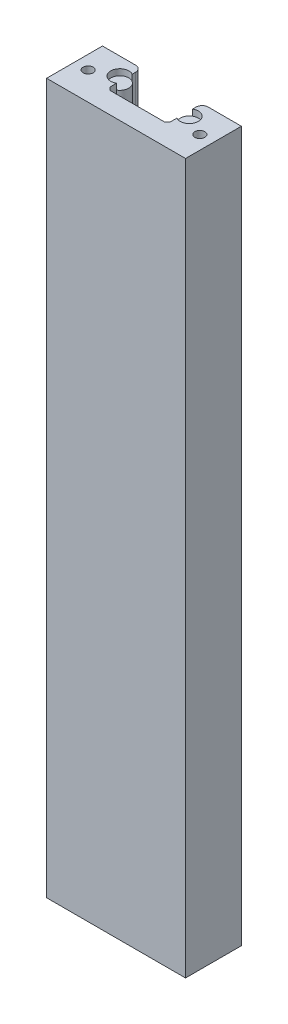
ISO-10303-21;
HEADER;
FILE_DESCRIPTION(('STEP AP214'),'2;1');
FILE_NAME('part.step','',(''),(''),'','','');
FILE_SCHEMA(('AUTOMOTIVE_DESIGN { 1 0 10303 214 1 1 1 1 }'));
ENDSEC;
DATA;
#1=APPLICATION_CONTEXT('core data for automotive mechanical design processes');
#2=APPLICATION_PROTOCOL_DEFINITION('international standard','automotive_design',2000,#1);
#3=PRODUCT_CONTEXT('',#1,'mechanical');
#4=PRODUCT('Part','Part','',(#3));
#5=PRODUCT_RELATED_PRODUCT_CATEGORY('part','',(#4));
#6=PRODUCT_DEFINITION_FORMATION('','',#4);
#7=PRODUCT_DEFINITION_CONTEXT('part definition',#1,'design');
#8=PRODUCT_DEFINITION('design','',#6,#7);
#9=PRODUCT_DEFINITION_SHAPE('','',#8);
#10=(LENGTH_UNIT() NAMED_UNIT(*) SI_UNIT(.MILLI.,.METRE.));
#11=(NAMED_UNIT(*) PLANE_ANGLE_UNIT() SI_UNIT($,.RADIAN.));
#12=(NAMED_UNIT(*) SI_UNIT($,.STERADIAN.) SOLID_ANGLE_UNIT());
#13=UNCERTAINTY_MEASURE_WITH_UNIT(LENGTH_MEASURE(1.E-05),#10,'distance_accuracy_value','');
#14=(GEOMETRIC_REPRESENTATION_CONTEXT(3) GLOBAL_UNCERTAINTY_ASSIGNED_CONTEXT((#13)) GLOBAL_UNIT_ASSIGNED_CONTEXT((#10,
#11,#12)) REPRESENTATION_CONTEXT('',''));
#15=CARTESIAN_POINT('',(0.,0.,0.));
#16=DIRECTION('',(0.,0.,1.));
#17=DIRECTION('',(1.,0.,0.));
#18=AXIS2_PLACEMENT_3D('',#15,#16,#17);
#19=CARTESIAN_POINT('',(11.5,115.5,-12.75));
#20=DIRECTION('',(0.,-1.,0.));
#21=DIRECTION('',(0.,0.,-1.));
#22=AXIS2_PLACEMENT_3D('',#19,#20,#21);
#23=CYLINDRICAL_SURFACE('',#22,2.95);
#24=CARTESIAN_POINT('',(11.5,115.5,-12.75));
#25=DIRECTION('',(0.,1.,0.));
#26=DIRECTION('',(0.,0.,-1.));
#27=AXIS2_PLACEMENT_3D('',#24,#25,#26);
#28=CIRCLE('',#27,2.95);
#29=CARTESIAN_POINT('',(11.5,115.5,-15.7));
#30=VERTEX_POINT('',#29);
#31=EDGE_CURVE('E11',#30,#30,#28,.T.);
#32=ORIENTED_EDGE('',*,*,#31,.F.);
#33=EDGE_LOOP('',(#32));
#34=FACE_BOUND('',#33,.T.);
#35=CARTESIAN_POINT('',(11.5,-115.5,-12.75));
#36=DIRECTION('',(0.,1.,0.));
#37=DIRECTION('',(0.,0.,-1.));
#38=AXIS2_PLACEMENT_3D('',#35,#36,#37);
#39=CIRCLE('',#38,2.95);
#40=CARTESIAN_POINT('',(11.5,-115.5,-15.7));
#41=VERTEX_POINT('',#40);
#42=EDGE_CURVE('E45',#41,#41,#39,.T.);
#43=ORIENTED_EDGE('',*,*,#42,.T.);
#44=EDGE_LOOP('',(#43));
#45=FACE_BOUND('',#44,.T.);
#46=ADVANCED_FACE('F42',(#34,#45),#23,.T.);
#47=CARTESIAN_POINT('',(11.5,115.5,-12.75));
#48=DIRECTION('',(0.,-1.,0.));
#49=DIRECTION('',(0.,0.,-1.));
#50=AXIS2_PLACEMENT_3D('',#47,#48,#49);
#51=PLANE('',#50);
#52=ORIENTED_EDGE('',*,*,#31,.T.);
#53=EDGE_LOOP('',(#52));
#54=FACE_BOUND('',#53,.T.);
#55=ADVANCED_FACE('F57',(#54),#51,.F.);
#56=CARTESIAN_POINT('',(11.5,-115.5,-12.75));
#57=DIRECTION('',(0.,-1.,0.));
#58=DIRECTION('',(0.,0.,-1.));
#59=AXIS2_PLACEMENT_3D('',#56,#57,#58);
#60=PLANE('',#59);
#61=ORIENTED_EDGE('',*,*,#42,.F.);
#62=EDGE_LOOP('',(#61));
#63=FACE_BOUND('',#62,.T.);
#64=ADVANCED_FACE('F55',(#63),#60,.T.);
#65=CLOSED_SHELL('',(#46,#55,#64));
#66=MANIFOLD_SOLID_BREP('B2',#65);
#67=CARTESIAN_POINT('',(-11.5,115.5,-12.75));
#68=DIRECTION('',(0.,-1.,0.));
#69=DIRECTION('',(0.,0.,-1.));
#70=AXIS2_PLACEMENT_3D('',#67,#68,#69);
#71=CYLINDRICAL_SURFACE('',#70,2.95);
#72=CARTESIAN_POINT('',(-11.5,115.5,-12.75));
#73=DIRECTION('',(0.,1.,0.));
#74=DIRECTION('',(0.,0.,1.));
#75=AXIS2_PLACEMENT_3D('',#72,#73,#74);
#76=CIRCLE('',#75,2.95);
#77=CARTESIAN_POINT('',(-11.5,115.5,-9.79999999999999));
#78=VERTEX_POINT('',#77);
#79=EDGE_CURVE('E41',#78,#78,#76,.T.);
#80=ORIENTED_EDGE('',*,*,#79,.F.);
#81=EDGE_LOOP('',(#80));
#82=FACE_BOUND('',#81,.T.);
#83=CARTESIAN_POINT('',(-11.5,-115.5,-12.75));
#84=DIRECTION('',(0.,1.,0.));
#85=DIRECTION('',(0.,0.,1.));
#86=AXIS2_PLACEMENT_3D('',#83,#84,#85);
#87=CIRCLE('',#86,2.95);
#88=CARTESIAN_POINT('',(-11.5,-115.5,-9.79999999999999));
#89=VERTEX_POINT('',#88);
#90=EDGE_CURVE('E95',#89,#89,#87,.T.);
#91=ORIENTED_EDGE('',*,*,#90,.T.);
#92=EDGE_LOOP('',(#91));
#93=FACE_BOUND('',#92,.T.);
#94=ADVANCED_FACE('F92',(#82,#93),#71,.T.);
#95=CARTESIAN_POINT('',(-11.5,115.5,-12.75));
#96=DIRECTION('',(0.,1.,0.));
#97=DIRECTION('',(0.,0.,1.));
#98=AXIS2_PLACEMENT_3D('',#95,#96,#97);
#99=PLANE('',#98);
#100=ORIENTED_EDGE('',*,*,#79,.T.);
#101=EDGE_LOOP('',(#100));
#102=FACE_BOUND('',#101,.T.);
#103=ADVANCED_FACE('F107',(#102),#99,.T.);
#104=CARTESIAN_POINT('',(-11.5,-115.5,-12.75));
#105=DIRECTION('',(0.,1.,0.));
#106=DIRECTION('',(0.,0.,1.));
#107=AXIS2_PLACEMENT_3D('',#104,#105,#106);
#108=PLANE('',#107);
#109=ORIENTED_EDGE('',*,*,#90,.F.);
#110=EDGE_LOOP('',(#109));
#111=FACE_BOUND('',#110,.T.);
#112=ADVANCED_FACE('F105',(#111),#108,.F.);
#113=CLOSED_SHELL('',(#94,#103,#112));
#114=MANIFOLD_SOLID_BREP('B6',#113);
#115=CARTESIAN_POINT('',(-23.,117.5,0.));
#116=DIRECTION('',(1.,0.,0.));
#117=DIRECTION('',(0.,0.,-1.));
#118=AXIS2_PLACEMENT_3D('',#115,#116,#117);
#119=PLANE('',#118);
#120=DIRECTION('',(0.,0.,1.));
#121=VECTOR('',#120,1.);
#122=CARTESIAN_POINT('',(-23.,-117.5,0.));
#123=LINE('',#122,#121);
#124=CARTESIAN_POINT('',(-23.,-117.5,-18.5));
#125=VERTEX_POINT('',#124);
#126=CARTESIAN_POINT('',(-23.,-117.5,0.));
#127=VERTEX_POINT('',#126);
#128=EDGE_CURVE('E268',#125,#127,#123,.T.);
#129=ORIENTED_EDGE('',*,*,#128,.T.);
#130=DIRECTION('',(0.,-1.,0.));
#131=VECTOR('',#130,1.);
#132=CARTESIAN_POINT('',(-23.,117.5,0.));
#133=LINE('',#132,#131);
#134=CARTESIAN_POINT('',(-23.,117.5,0.));
#135=VERTEX_POINT('',#134);
#136=EDGE_CURVE('E250',#135,#127,#133,.T.);
#137=ORIENTED_EDGE('',*,*,#136,.F.);
#138=DIRECTION('',(0.,0.,1.));
#139=VECTOR('',#138,1.);
#140=CARTESIAN_POINT('',(-23.,117.5,0.));
#141=LINE('',#140,#139);
#142=CARTESIAN_POINT('',(-23.,117.5,-18.5));
#143=VERTEX_POINT('',#142);
#144=EDGE_CURVE('E256',#143,#135,#141,.T.);
#145=ORIENTED_EDGE('',*,*,#144,.F.);
#146=DIRECTION('',(0.,-1.,0.));
#147=VECTOR('',#146,1.);
#148=CARTESIAN_POINT('',(-23.,117.5,-18.5));
#149=LINE('',#148,#147);
#150=EDGE_CURVE('E319',#143,#125,#149,.T.);
#151=ORIENTED_EDGE('',*,*,#150,.T.);
#152=EDGE_LOOP('',(#129,#137,#145,#151));
#153=FACE_BOUND('',#152,.T.);
#154=ADVANCED_FACE('F133',(#153),#119,.F.);
#155=CARTESIAN_POINT('',(23.,117.5,0.));
#156=DIRECTION('',(0.,0.,-1.));
#157=DIRECTION('',(-1.,0.,0.));
#158=AXIS2_PLACEMENT_3D('',#155,#156,#157);
#159=PLANE('',#158);
#160=DIRECTION('',(1.,0.,0.));
#161=VECTOR('',#160,1.);
#162=CARTESIAN_POINT('',(23.,-117.5,0.));
#163=LINE('',#162,#161);
#164=CARTESIAN_POINT('',(23.,-117.5,0.));
#165=VERTEX_POINT('',#164);
#166=EDGE_CURVE('E349',#127,#165,#163,.T.);
#167=ORIENTED_EDGE('',*,*,#166,.T.);
#168=DIRECTION('',(0.,-1.,0.));
#169=VECTOR('',#168,1.);
#170=CARTESIAN_POINT('',(23.,117.5,0.));
#171=LINE('',#170,#169);
#172=CARTESIAN_POINT('',(23.,117.5,0.));
#173=VERTEX_POINT('',#172);
#174=EDGE_CURVE('E253',#173,#165,#171,.T.);
#175=ORIENTED_EDGE('',*,*,#174,.F.);
#176=DIRECTION('',(1.,0.,0.));
#177=VECTOR('',#176,1.);
#178=CARTESIAN_POINT('',(23.,117.5,0.));
#179=LINE('',#178,#177);
#180=EDGE_CURVE('E246',#135,#173,#179,.T.);
#181=ORIENTED_EDGE('',*,*,#180,.F.);
#182=ORIENTED_EDGE('',*,*,#136,.T.);
#183=EDGE_LOOP('',(#167,#175,#181,#182));
#184=FACE_BOUND('',#183,.T.);
#185=ADVANCED_FACE('F248',(#184),#159,.F.);
#186=CARTESIAN_POINT('',(23.,117.5,0.));
#187=DIRECTION('',(-1.,0.,0.));
#188=DIRECTION('',(0.,0.,1.));
#189=AXIS2_PLACEMENT_3D('',#186,#187,#188);
#190=PLANE('',#189);
#191=DIRECTION('',(0.,0.,-1.));
#192=VECTOR('',#191,1.);
#193=CARTESIAN_POINT('',(23.,-117.5,0.));
#194=LINE('',#193,#192);
#195=CARTESIAN_POINT('',(23.,-117.5,-18.5));
#196=VERTEX_POINT('',#195);
#197=EDGE_CURVE('E344',#165,#196,#194,.T.);
#198=ORIENTED_EDGE('',*,*,#197,.T.);
#199=DIRECTION('',(0.,-1.,0.));
#200=VECTOR('',#199,1.);
#201=CARTESIAN_POINT('',(23.,117.5,-18.5));
#202=LINE('',#201,#200);
#203=CARTESIAN_POINT('',(23.,117.5,-18.5));
#204=VERTEX_POINT('',#203);
#205=EDGE_CURVE('E273',#204,#196,#202,.T.);
#206=ORIENTED_EDGE('',*,*,#205,.F.);
#207=DIRECTION('',(0.,0.,-1.));
#208=VECTOR('',#207,1.);
#209=CARTESIAN_POINT('',(23.,117.5,0.));
#210=LINE('',#209,#208);
#211=EDGE_CURVE('E255',#173,#204,#210,.T.);
#212=ORIENTED_EDGE('',*,*,#211,.F.);
#213=ORIENTED_EDGE('',*,*,#174,.T.);
#214=EDGE_LOOP('',(#198,#206,#212,#213));
#215=FACE_BOUND('',#214,.T.);
#216=ADVANCED_FACE('F378',(#215),#190,.F.);
#217=CARTESIAN_POINT('',(23.,117.5,-18.5));
#218=DIRECTION('',(0.,0.,1.));
#219=DIRECTION('',(1.,0.,0.));
#220=AXIS2_PLACEMENT_3D('',#217,#218,#219);
#221=PLANE('',#220);
#222=DIRECTION('',(-1.,0.,0.));
#223=VECTOR('',#222,1.);
#224=CARTESIAN_POINT('',(23.,-117.5,-18.5));
#225=LINE('',#224,#223);
#226=CARTESIAN_POINT('',(12.,-117.5,-18.5));
#227=VERTEX_POINT('',#226);
#228=EDGE_CURVE('E339',#196,#227,#225,.T.);
#229=ORIENTED_EDGE('',*,*,#228,.T.);
#230=DIRECTION('',(0.,-1.,0.));
#231=VECTOR('',#230,1.);
#232=CARTESIAN_POINT('',(12.,117.5,-18.5));
#233=LINE('',#232,#231);
#234=CARTESIAN_POINT('',(12.,117.5,-18.5));
#235=VERTEX_POINT('',#234);
#236=EDGE_CURVE('E299',#227,#235,#233,.F.);
#237=ORIENTED_EDGE('',*,*,#236,.T.);
#238=DIRECTION('',(-1.,0.,0.));
#239=VECTOR('',#238,1.);
#240=CARTESIAN_POINT('',(23.,117.5,-18.5));
#241=LINE('',#240,#239);
#242=EDGE_CURVE('E341',#204,#235,#241,.T.);
#243=ORIENTED_EDGE('',*,*,#242,.F.);
#244=ORIENTED_EDGE('',*,*,#205,.T.);
#245=EDGE_LOOP('',(#229,#237,#243,#244));
#246=FACE_BOUND('',#245,.T.);
#247=ADVANCED_FACE('F338',(#246),#221,.F.);
#248=CARTESIAN_POINT('',(10.,117.5,-18.5));
#249=DIRECTION('',(1.,0.,0.));
#250=DIRECTION('',(0.,0.,-1.));
#251=AXIS2_PLACEMENT_3D('',#248,#249,#250);
#252=PLANE('',#251);
#253=DIRECTION('',(0.,0.,1.));
#254=VECTOR('',#253,1.);
#255=CARTESIAN_POINT('',(10.,117.5,-18.5));
#256=LINE('',#255,#254);
#257=CARTESIAN_POINT('',(10.,117.5,-16.5));
#258=VERTEX_POINT('',#257);
#259=CARTESIAN_POINT('',(10.,117.5,-15.3480762113533));
#260=VERTEX_POINT('',#259);
#261=EDGE_CURVE('E380',#258,#260,#256,.T.);
#262=ORIENTED_EDGE('',*,*,#261,.F.);
#263=DIRECTION('',(0.,-1.,0.));
#264=VECTOR('',#263,1.);
#265=CARTESIAN_POINT('',(10.,117.5,-16.5));
#266=LINE('',#265,#264);
#267=CARTESIAN_POINT('',(10.,-117.5,-16.5));
#268=VERTEX_POINT('',#267);
#269=EDGE_CURVE('E292',#258,#268,#266,.T.);
#270=ORIENTED_EDGE('',*,*,#269,.T.);
#271=DIRECTION('',(0.,0.,1.));
#272=VECTOR('',#271,1.);
#273=CARTESIAN_POINT('',(10.,-117.5,-18.5));
#274=LINE('',#273,#272);
#275=CARTESIAN_POINT('',(10.,-117.5,-15.3480762113533));
#276=VERTEX_POINT('',#275);
#277=EDGE_CURVE('E345',#268,#276,#274,.T.);
#278=ORIENTED_EDGE('',*,*,#277,.T.);
#279=DIRECTION('',(0.,-1.,0.));
#280=VECTOR('',#279,1.);
#281=CARTESIAN_POINT('',(10.,117.5,-15.3480762113533));
#282=LINE('',#281,#280);
#283=EDGE_CURVE('E330',#260,#276,#282,.T.);
#284=ORIENTED_EDGE('',*,*,#283,.F.);
#285=EDGE_LOOP('',(#262,#270,#278,#284));
#286=FACE_BOUND('',#285,.T.);
#287=ADVANCED_FACE('F432',(#286),#252,.F.);
#288=CARTESIAN_POINT('',(11.5,117.5,-12.75));
#289=DIRECTION('',(0.,-1.,0.));
#290=DIRECTION('',(0.,0.,-1.));
#291=AXIS2_PLACEMENT_3D('',#288,#289,#290);
#292=CYLINDRICAL_SURFACE('',#291,3.);
#293=CARTESIAN_POINT('',(11.5,-117.5,-12.75));
#294=DIRECTION('',(0.,-1.,0.));
#295=DIRECTION('',(0.,0.,-1.));
#296=AXIS2_PLACEMENT_3D('',#293,#294,#295);
#297=CIRCLE('',#296,3.);
#298=CARTESIAN_POINT('',(10.,-117.5,-10.1519237886467));
#299=VERTEX_POINT('',#298);
#300=EDGE_CURVE('E347',#276,#299,#297,.T.);
#301=ORIENTED_EDGE('',*,*,#300,.T.);
#302=DIRECTION('',(0.,-1.,0.));
#303=VECTOR('',#302,1.);
#304=CARTESIAN_POINT('',(10.,117.5,-10.1519237886467));
#305=LINE('',#304,#303);
#306=CARTESIAN_POINT('',(10.,117.5,-10.1519237886467));
#307=VERTEX_POINT('',#306);
#308=EDGE_CURVE('E327',#307,#299,#305,.T.);
#309=ORIENTED_EDGE('',*,*,#308,.F.);
#310=CARTESIAN_POINT('',(11.5,117.5,-12.75));
#311=DIRECTION('',(0.,-1.,0.));
#312=DIRECTION('',(0.,0.,-1.));
#313=AXIS2_PLACEMENT_3D('',#310,#311,#312);
#314=CIRCLE('',#313,3.);
#315=EDGE_CURVE('E384',#260,#307,#314,.T.);
#316=ORIENTED_EDGE('',*,*,#315,.F.);
#317=ORIENTED_EDGE('',*,*,#283,.T.);
#318=EDGE_LOOP('',(#301,#309,#316,#317));
#319=FACE_BOUND('',#318,.T.);
#320=ADVANCED_FACE('F435',(#319),#292,.F.);
#321=CARTESIAN_POINT('',(10.,117.5,-10.1519237886467));
#322=DIRECTION('',(1.,0.,0.));
#323=DIRECTION('',(0.,0.,-1.));
#324=AXIS2_PLACEMENT_3D('',#321,#322,#323);
#325=PLANE('',#324);
#326=DIRECTION('',(0.,0.,1.));
#327=VECTOR('',#326,1.);
#328=CARTESIAN_POINT('',(10.,-117.5,-10.1519237886467));
#329=LINE('',#328,#327);
#330=CARTESIAN_POINT('',(10.,-117.5,-8.));
#331=VERTEX_POINT('',#330);
#332=EDGE_CURVE('E354',#299,#331,#329,.T.);
#333=ORIENTED_EDGE('',*,*,#332,.T.);
#334=DIRECTION('',(0.,1.,0.));
#335=VECTOR('',#334,1.);
#336=CARTESIAN_POINT('',(10.,117.5,-8.));
#337=LINE('',#336,#335);
#338=CARTESIAN_POINT('',(10.,117.5,-8.));
#339=VERTEX_POINT('',#338);
#340=EDGE_CURVE('E279',#331,#339,#337,.T.);
#341=ORIENTED_EDGE('',*,*,#340,.T.);
#342=DIRECTION('',(0.,0.,1.));
#343=VECTOR('',#342,1.);
#344=CARTESIAN_POINT('',(10.,117.5,-10.1519237886467));
#345=LINE('',#344,#343);
#346=EDGE_CURVE('E386',#307,#339,#345,.T.);
#347=ORIENTED_EDGE('',*,*,#346,.F.);
#348=ORIENTED_EDGE('',*,*,#308,.T.);
#349=EDGE_LOOP('',(#333,#341,#347,#348));
#350=FACE_BOUND('',#349,.T.);
#351=ADVANCED_FACE('F439',(#350),#325,.F.);
#352=CARTESIAN_POINT('',(-10.,117.5,-7.));
#353=DIRECTION('',(0.,0.,1.));
#354=DIRECTION('',(1.,0.,0.));
#355=AXIS2_PLACEMENT_3D('',#352,#353,#354);
#356=PLANE('',#355);
#357=DIRECTION('',(-1.,0.,0.));
#358=VECTOR('',#357,1.);
#359=CARTESIAN_POINT('',(-10.,117.5,-7.));
#360=LINE('',#359,#358);
#361=CARTESIAN_POINT('',(9.,117.5,-7.));
#362=VERTEX_POINT('',#361);
#363=CARTESIAN_POINT('',(-8.99999999999997,117.5,-7.));
#364=VERTEX_POINT('',#363);
#365=EDGE_CURVE('E389',#362,#364,#360,.T.);
#366=ORIENTED_EDGE('',*,*,#365,.F.);
#367=DIRECTION('',(0.,-1.,0.));
#368=VECTOR('',#367,1.);
#369=CARTESIAN_POINT('',(9.,-117.5,-7.));
#370=LINE('',#369,#368);
#371=CARTESIAN_POINT('',(9.,-117.5,-7.));
#372=VERTEX_POINT('',#371);
#373=EDGE_CURVE('E271',#362,#372,#370,.T.);
#374=ORIENTED_EDGE('',*,*,#373,.T.);
#375=DIRECTION('',(-1.,0.,0.));
#376=VECTOR('',#375,1.);
#377=CARTESIAN_POINT('',(-10.,-117.5,-7.));
#378=LINE('',#377,#376);
#379=CARTESIAN_POINT('',(-8.99999999999997,-117.5,-7.));
#380=VERTEX_POINT('',#379);
#381=EDGE_CURVE('E357',#372,#380,#378,.T.);
#382=ORIENTED_EDGE('',*,*,#381,.T.);
#383=DIRECTION('',(0.,1.,0.));
#384=VECTOR('',#383,1.);
#385=CARTESIAN_POINT('',(-8.99999999999997,117.5,-7.));
#386=LINE('',#385,#384);
#387=EDGE_CURVE('E269',#380,#364,#386,.T.);
#388=ORIENTED_EDGE('',*,*,#387,.T.);
#389=EDGE_LOOP('',(#366,#374,#382,#388));
#390=FACE_BOUND('',#389,.T.);
#391=ADVANCED_FACE('F401',(#390),#356,.F.);
#392=CARTESIAN_POINT('',(-10.,117.5,-10.1519237886467));
#393=DIRECTION('',(-1.,0.,0.));
#394=DIRECTION('',(0.,0.,1.));
#395=AXIS2_PLACEMENT_3D('',#392,#393,#394);
#396=PLANE('',#395);
#397=DIRECTION('',(0.,0.,-1.));
#398=VECTOR('',#397,1.);
#399=CARTESIAN_POINT('',(-10.,117.5,-10.1519237886467));
#400=LINE('',#399,#398);
#401=CARTESIAN_POINT('',(-10.,117.5,-8.));
#402=VERTEX_POINT('',#401);
#403=CARTESIAN_POINT('',(-10.,117.5,-10.1519237886467));
#404=VERTEX_POINT('',#403);
#405=EDGE_CURVE('E373',#402,#404,#400,.T.);
#406=ORIENTED_EDGE('',*,*,#405,.F.);
#407=DIRECTION('',(0.,-1.,0.));
#408=VECTOR('',#407,1.);
#409=CARTESIAN_POINT('',(-10.,-117.5,-8.));
#410=LINE('',#409,#408);
#411=CARTESIAN_POINT('',(-10.,-117.5,-8.));
#412=VERTEX_POINT('',#411);
#413=EDGE_CURVE('E281',#402,#412,#410,.T.);
#414=ORIENTED_EDGE('',*,*,#413,.T.);
#415=DIRECTION('',(0.,0.,-1.));
#416=VECTOR('',#415,1.);
#417=CARTESIAN_POINT('',(-10.,-117.5,-10.1519237886467));
#418=LINE('',#417,#416);
#419=CARTESIAN_POINT('',(-10.,-117.5,-10.1519237886467));
#420=VERTEX_POINT('',#419);
#421=EDGE_CURVE('E360',#412,#420,#418,.T.);
#422=ORIENTED_EDGE('',*,*,#421,.T.);
#423=DIRECTION('',(0.,-1.,0.));
#424=VECTOR('',#423,1.);
#425=CARTESIAN_POINT('',(-10.,117.5,-10.1519237886467));
#426=LINE('',#425,#424);
#427=EDGE_CURVE('E324',#404,#420,#426,.T.);
#428=ORIENTED_EDGE('',*,*,#427,.F.);
#429=EDGE_LOOP('',(#406,#414,#422,#428));
#430=FACE_BOUND('',#429,.T.);
#431=ADVANCED_FACE('F395',(#430),#396,.F.);
#432=CARTESIAN_POINT('',(-11.5,117.5,-12.75));
#433=DIRECTION('',(0.,-1.,0.));
#434=DIRECTION('',(0.,0.,-1.));
#435=AXIS2_PLACEMENT_3D('',#432,#433,#434);
#436=CYLINDRICAL_SURFACE('',#435,3.);
#437=CARTESIAN_POINT('',(-11.5,-117.5,-12.75));
#438=DIRECTION('',(0.,-1.,0.));
#439=DIRECTION('',(0.,0.,1.));
#440=AXIS2_PLACEMENT_3D('',#437,#438,#439);
#441=CIRCLE('',#440,3.);
#442=CARTESIAN_POINT('',(-10.,-117.5,-15.3480762113533));
#443=VERTEX_POINT('',#442);
#444=EDGE_CURVE('E315',#420,#443,#441,.T.);
#445=ORIENTED_EDGE('',*,*,#444,.T.);
#446=DIRECTION('',(0.,-1.,0.));
#447=VECTOR('',#446,1.);
#448=CARTESIAN_POINT('',(-10.,117.5,-15.3480762113533));
#449=LINE('',#448,#447);
#450=CARTESIAN_POINT('',(-10.,117.5,-15.3480762113533));
#451=VERTEX_POINT('',#450);
#452=EDGE_CURVE('E321',#451,#443,#449,.T.);
#453=ORIENTED_EDGE('',*,*,#452,.F.);
#454=CARTESIAN_POINT('',(-11.5,117.5,-12.75));
#455=DIRECTION('',(0.,-1.,0.));
#456=DIRECTION('',(0.,0.,1.));
#457=AXIS2_PLACEMENT_3D('',#454,#455,#456);
#458=CIRCLE('',#457,3.);
#459=EDGE_CURVE('E370',#404,#451,#458,.T.);
#460=ORIENTED_EDGE('',*,*,#459,.F.);
#461=ORIENTED_EDGE('',*,*,#427,.T.);
#462=EDGE_LOOP('',(#445,#453,#460,#461));
#463=FACE_BOUND('',#462,.T.);
#464=ADVANCED_FACE('F364',(#463),#436,.F.);
#465=CARTESIAN_POINT('',(-10.,117.5,-18.5));
#466=DIRECTION('',(-1.,0.,0.));
#467=DIRECTION('',(0.,0.,1.));
#468=AXIS2_PLACEMENT_3D('',#465,#466,#467);
#469=PLANE('',#468);
#470=DIRECTION('',(0.,0.,-1.));
#471=VECTOR('',#470,1.);
#472=CARTESIAN_POINT('',(-10.,-117.5,-18.5));
#473=LINE('',#472,#471);
#474=CARTESIAN_POINT('',(-10.,-117.5,-16.5));
#475=VERTEX_POINT('',#474);
#476=EDGE_CURVE('E313',#443,#475,#473,.T.);
#477=ORIENTED_EDGE('',*,*,#476,.T.);
#478=DIRECTION('',(0.,-1.,0.));
#479=VECTOR('',#478,1.);
#480=CARTESIAN_POINT('',(-10.,117.5,-16.5));
#481=LINE('',#480,#479);
#482=CARTESIAN_POINT('',(-10.,117.5,-16.5));
#483=VERTEX_POINT('',#482);
#484=EDGE_CURVE('E90',#475,#483,#481,.F.);
#485=ORIENTED_EDGE('',*,*,#484,.T.);
#486=DIRECTION('',(0.,0.,-1.));
#487=VECTOR('',#486,1.);
#488=CARTESIAN_POINT('',(-10.,117.5,-18.5));
#489=LINE('',#488,#487);
#490=EDGE_CURVE('E369',#451,#483,#489,.T.);
#491=ORIENTED_EDGE('',*,*,#490,.F.);
#492=ORIENTED_EDGE('',*,*,#452,.T.);
#493=EDGE_LOOP('',(#477,#485,#491,#492));
#494=FACE_BOUND('',#493,.T.);
#495=ADVANCED_FACE('F368',(#494),#469,.F.);
#496=CARTESIAN_POINT('',(-23.,117.5,-18.5));
#497=DIRECTION('',(0.,0.,1.));
#498=DIRECTION('',(1.,0.,0.));
#499=AXIS2_PLACEMENT_3D('',#496,#497,#498);
#500=PLANE('',#499);
#501=DIRECTION('',(-1.,0.,0.));
#502=VECTOR('',#501,1.);
#503=CARTESIAN_POINT('',(-23.,117.5,-18.5));
#504=LINE('',#503,#502);
#505=CARTESIAN_POINT('',(-12.,117.5,-18.5));
#506=VERTEX_POINT('',#505);
#507=EDGE_CURVE('E261',#506,#143,#504,.T.);
#508=ORIENTED_EDGE('',*,*,#507,.F.);
#509=DIRECTION('',(0.,-1.,0.));
#510=VECTOR('',#509,1.);
#511=CARTESIAN_POINT('',(-12.,117.5,-18.5));
#512=LINE('',#511,#510);
#513=CARTESIAN_POINT('',(-12.,-117.5,-18.5));
#514=VERTEX_POINT('',#513);
#515=EDGE_CURVE('E141',#506,#514,#512,.T.);
#516=ORIENTED_EDGE('',*,*,#515,.T.);
#517=DIRECTION('',(-1.,0.,0.));
#518=VECTOR('',#517,1.);
#519=CARTESIAN_POINT('',(-23.,-117.5,-18.5));
#520=LINE('',#519,#518);
#521=EDGE_CURVE('E265',#514,#125,#520,.T.);
#522=ORIENTED_EDGE('',*,*,#521,.T.);
#523=ORIENTED_EDGE('',*,*,#150,.F.);
#524=EDGE_LOOP('',(#508,#516,#522,#523));
#525=FACE_BOUND('',#524,.T.);
#526=ADVANCED_FACE('F307',(#525),#500,.F.);
#527=CARTESIAN_POINT('',(-11.5,117.5,-12.75));
#528=DIRECTION('',(0.,1.,0.));
#529=DIRECTION('',(0.,0.,1.));
#530=AXIS2_PLACEMENT_3D('',#527,#528,#529);
#531=PLANE('',#530);
#532=CARTESIAN_POINT('',(-18.5,117.5,-9.25));
#533=DIRECTION('',(0.,1.,0.));
#534=DIRECTION('',(0.,0.,1.));
#535=AXIS2_PLACEMENT_3D('',#532,#533,#534);
#536=CIRCLE('',#535,1.65);
#537=CARTESIAN_POINT('',(-18.5,117.5,-7.6));
#538=VERTEX_POINT('',#537);
#539=EDGE_CURVE('E538',#538,#538,#536,.T.);
#540=ORIENTED_EDGE('',*,*,#539,.F.);
#541=EDGE_LOOP('',(#540));
#542=FACE_BOUND('',#541,.T.);
#543=CARTESIAN_POINT('',(18.5,117.5,-9.24999999999993));
#544=DIRECTION('',(0.,1.,0.));
#545=DIRECTION('',(0.,0.,-1.));
#546=AXIS2_PLACEMENT_3D('',#543,#544,#545);
#547=CIRCLE('',#546,1.64999999999999);
#548=CARTESIAN_POINT('',(18.5,117.5,-10.8999999999999));
#549=VERTEX_POINT('',#548);
#550=EDGE_CURVE('E533',#549,#549,#547,.T.);
#551=ORIENTED_EDGE('',*,*,#550,.F.);
#552=EDGE_LOOP('',(#551));
#553=FACE_BOUND('',#552,.T.);
#554=ORIENTED_EDGE('',*,*,#242,.T.);
#555=CARTESIAN_POINT('',(12.,117.5,-16.5));
#556=DIRECTION('',(0.,1.,0.));
#557=DIRECTION('',(0.,0.,1.));
#558=AXIS2_PLACEMENT_3D('',#555,#556,#557);
#559=CIRCLE('',#558,2.);
#560=EDGE_CURVE('E302',#235,#258,#559,.T.);
#561=ORIENTED_EDGE('',*,*,#560,.T.);
#562=ORIENTED_EDGE('',*,*,#261,.T.);
#563=ORIENTED_EDGE('',*,*,#315,.T.);
#564=ORIENTED_EDGE('',*,*,#346,.T.);
#565=DIRECTION('',(0.707106781186547,0.,-0.707106781186548));
#566=VECTOR('',#565,1.);
#567=CARTESIAN_POINT('',(9.,117.5,-7.));
#568=LINE('',#567,#566);
#569=EDGE_CURVE('E286',#339,#362,#568,.F.);
#570=ORIENTED_EDGE('',*,*,#569,.T.);
#571=ORIENTED_EDGE('',*,*,#365,.T.);
#572=DIRECTION('',(0.707106781186558,0.,0.707106781186537));
#573=VECTOR('',#572,1.);
#574=CARTESIAN_POINT('',(-10.,117.5,-8.));
#575=LINE('',#574,#573);
#576=EDGE_CURVE('E290',#364,#402,#575,.F.);
#577=ORIENTED_EDGE('',*,*,#576,.T.);
#578=ORIENTED_EDGE('',*,*,#405,.T.);
#579=ORIENTED_EDGE('',*,*,#459,.T.);
#580=ORIENTED_EDGE('',*,*,#490,.T.);
#581=CARTESIAN_POINT('',(-12.,117.5,-16.5));
#582=DIRECTION('',(0.,1.,0.));
#583=DIRECTION('',(0.,0.,1.));
#584=AXIS2_PLACEMENT_3D('',#581,#582,#583);
#585=CIRCLE('',#584,2.);
#586=EDGE_CURVE('E148',#483,#506,#585,.T.);
#587=ORIENTED_EDGE('',*,*,#586,.T.);
#588=ORIENTED_EDGE('',*,*,#507,.T.);
#589=ORIENTED_EDGE('',*,*,#144,.T.);
#590=ORIENTED_EDGE('',*,*,#180,.T.);
#591=ORIENTED_EDGE('',*,*,#211,.T.);
#592=EDGE_LOOP('',(#554,#561,#562,#563,#564,#570,#571,#577,#578,#579,#580,#587,#588,#589,#590,#591));
#593=FACE_BOUND('',#592,.T.);
#594=ADVANCED_FACE('F260',(#542,#553,#593),#531,.T.);
#595=CARTESIAN_POINT('',(-11.5,-117.5,-12.75));
#596=DIRECTION('',(0.,1.,0.));
#597=DIRECTION('',(0.,0.,1.));
#598=AXIS2_PLACEMENT_3D('',#595,#596,#597);
#599=PLANE('',#598);
#600=CARTESIAN_POINT('',(-18.5,-117.5,-4.24999999999999));
#601=DIRECTION('',(0.,-1.,0.));
#602=DIRECTION('',(0.,0.,1.));
#603=AXIS2_PLACEMENT_3D('',#600,#601,#602);
#604=CIRCLE('',#603,1.65);
#605=CARTESIAN_POINT('',(-18.5,-117.5,-2.59999999999999));
#606=VERTEX_POINT('',#605);
#607=EDGE_CURVE('E525',#606,#606,#604,.T.);
#608=ORIENTED_EDGE('',*,*,#607,.F.);
#609=EDGE_LOOP('',(#608));
#610=FACE_BOUND('',#609,.T.);
#611=CARTESIAN_POINT('',(18.5,-117.5,-14.2499999999999));
#612=DIRECTION('',(0.,-1.,0.));
#613=DIRECTION('',(0.,0.,1.));
#614=AXIS2_PLACEMENT_3D('',#611,#612,#613);
#615=CIRCLE('',#614,1.65);
#616=CARTESIAN_POINT('',(18.5,-117.5,-12.5999999999999));
#617=VERTEX_POINT('',#616);
#618=EDGE_CURVE('E512',#617,#617,#615,.T.);
#619=ORIENTED_EDGE('',*,*,#618,.F.);
#620=EDGE_LOOP('',(#619));
#621=FACE_BOUND('',#620,.T.);
#622=CARTESIAN_POINT('',(18.5,-117.5,-4.24999999999992));
#623=DIRECTION('',(0.,-1.,0.));
#624=DIRECTION('',(0.,0.,-1.));
#625=AXIS2_PLACEMENT_3D('',#622,#623,#624);
#626=CIRCLE('',#625,1.64999999999999);
#627=CARTESIAN_POINT('',(18.5,-117.5,-5.89999999999992));
#628=VERTEX_POINT('',#627);
#629=EDGE_CURVE('E513',#628,#628,#626,.T.);
#630=ORIENTED_EDGE('',*,*,#629,.F.);
#631=EDGE_LOOP('',(#630));
#632=FACE_BOUND('',#631,.T.);
#633=CARTESIAN_POINT('',(-18.5,-117.5,-14.25));
#634=DIRECTION('',(0.,-1.,0.));
#635=DIRECTION('',(0.,0.,-1.));
#636=AXIS2_PLACEMENT_3D('',#633,#634,#635);
#637=CIRCLE('',#636,1.65);
#638=CARTESIAN_POINT('',(-18.5,-117.5,-15.9));
#639=VERTEX_POINT('',#638);
#640=EDGE_CURVE('E524',#639,#639,#637,.T.);
#641=ORIENTED_EDGE('',*,*,#640,.F.);
#642=EDGE_LOOP('',(#641));
#643=FACE_BOUND('',#642,.T.);
#644=ORIENTED_EDGE('',*,*,#277,.F.);
#645=CARTESIAN_POINT('',(12.,-117.5,-16.5));
#646=DIRECTION('',(0.,1.,0.));
#647=DIRECTION('',(0.,0.,1.));
#648=AXIS2_PLACEMENT_3D('',#645,#646,#647);
#649=CIRCLE('',#648,2.);
#650=EDGE_CURVE('E297',#268,#227,#649,.F.);
#651=ORIENTED_EDGE('',*,*,#650,.T.);
#652=ORIENTED_EDGE('',*,*,#228,.F.);
#653=ORIENTED_EDGE('',*,*,#197,.F.);
#654=ORIENTED_EDGE('',*,*,#166,.F.);
#655=ORIENTED_EDGE('',*,*,#128,.F.);
#656=ORIENTED_EDGE('',*,*,#521,.F.);
#657=CARTESIAN_POINT('',(-12.,-117.5,-16.5));
#658=DIRECTION('',(0.,1.,0.));
#659=DIRECTION('',(0.,0.,1.));
#660=AXIS2_PLACEMENT_3D('',#657,#658,#659);
#661=CIRCLE('',#660,2.);
#662=EDGE_CURVE('E295',#514,#475,#661,.F.);
#663=ORIENTED_EDGE('',*,*,#662,.T.);
#664=ORIENTED_EDGE('',*,*,#476,.F.);
#665=ORIENTED_EDGE('',*,*,#444,.F.);
#666=ORIENTED_EDGE('',*,*,#421,.F.);
#667=DIRECTION('',(-0.707106781186558,0.,-0.707106781186537));
#668=VECTOR('',#667,1.);
#669=CARTESIAN_POINT('',(-13.125,-117.5,-11.1249999999999));
#670=LINE('',#669,#668);
#671=EDGE_CURVE('E288',#412,#380,#670,.F.);
#672=ORIENTED_EDGE('',*,*,#671,.T.);
#673=ORIENTED_EDGE('',*,*,#381,.F.);
#674=DIRECTION('',(-0.707106781186547,0.,0.707106781186548));
#675=VECTOR('',#674,1.);
#676=CARTESIAN_POINT('',(1.62500000000001,-117.5,0.375));
#677=LINE('',#676,#675);
#678=EDGE_CURVE('E284',#372,#331,#677,.F.);
#679=ORIENTED_EDGE('',*,*,#678,.T.);
#680=ORIENTED_EDGE('',*,*,#332,.F.);
#681=ORIENTED_EDGE('',*,*,#300,.F.);
#682=EDGE_LOOP('',(#644,#651,#652,#653,#654,#655,#656,#663,#664,#665,#666,#672,#673,#679,#680,#681));
#683=FACE_BOUND('',#682,.T.);
#684=ADVANCED_FACE('F311',(#610,#621,#632,#643,#683),#599,.F.);
#685=CARTESIAN_POINT('',(9.,117.5,-7.));
#686=DIRECTION('',(-0.707106781186548,0.,-0.707106781186547));
#687=DIRECTION('',(0.,1.,0.));
#688=AXIS2_PLACEMENT_3D('',#685,#686,#687);
#689=PLANE('',#688);
#690=ORIENTED_EDGE('',*,*,#569,.F.);
#691=ORIENTED_EDGE('',*,*,#340,.F.);
#692=ORIENTED_EDGE('',*,*,#678,.F.);
#693=ORIENTED_EDGE('',*,*,#373,.F.);
#694=EDGE_LOOP('',(#690,#691,#692,#693));
#695=FACE_BOUND('',#694,.T.);
#696=ADVANCED_FACE('F406',(#695),#689,.T.);
#697=CARTESIAN_POINT('',(-10.,117.5,-8.));
#698=DIRECTION('',(0.707106781186537,0.,-0.707106781186558));
#699=DIRECTION('',(0.,1.,0.));
#700=AXIS2_PLACEMENT_3D('',#697,#698,#699);
#701=PLANE('',#700);
#702=ORIENTED_EDGE('',*,*,#576,.F.);
#703=ORIENTED_EDGE('',*,*,#387,.F.);
#704=ORIENTED_EDGE('',*,*,#671,.F.);
#705=ORIENTED_EDGE('',*,*,#413,.F.);
#706=EDGE_LOOP('',(#702,#703,#704,#705));
#707=FACE_BOUND('',#706,.T.);
#708=ADVANCED_FACE('F403',(#707),#701,.T.);
#709=CARTESIAN_POINT('',(12.,117.5,-16.5));
#710=DIRECTION('',(0.,-1.,0.));
#711=DIRECTION('',(0.,0.,-1.));
#712=AXIS2_PLACEMENT_3D('',#709,#710,#711);
#713=CYLINDRICAL_SURFACE('',#712,2.);
#714=ORIENTED_EDGE('',*,*,#560,.F.);
#715=ORIENTED_EDGE('',*,*,#236,.F.);
#716=ORIENTED_EDGE('',*,*,#650,.F.);
#717=ORIENTED_EDGE('',*,*,#269,.F.);
#718=EDGE_LOOP('',(#714,#715,#716,#717));
#719=FACE_BOUND('',#718,.T.);
#720=ADVANCED_FACE('F405',(#719),#713,.T.);
#721=CARTESIAN_POINT('',(-12.,117.5,-16.5));
#722=DIRECTION('',(0.,-1.,0.));
#723=DIRECTION('',(0.,0.,-1.));
#724=AXIS2_PLACEMENT_3D('',#721,#722,#723);
#725=CYLINDRICAL_SURFACE('',#724,2.);
#726=ORIENTED_EDGE('',*,*,#586,.F.);
#727=ORIENTED_EDGE('',*,*,#484,.F.);
#728=ORIENTED_EDGE('',*,*,#662,.F.);
#729=ORIENTED_EDGE('',*,*,#515,.F.);
#730=EDGE_LOOP('',(#726,#727,#728,#729));
#731=FACE_BOUND('',#730,.T.);
#732=ADVANCED_FACE('F135',(#731),#725,.T.);
#733=CARTESIAN_POINT('',(18.5,92.5,-9.24999999999993));
#734=DIRECTION('',(0.,1.,0.));
#735=DIRECTION('',(0.,0.,1.));
#736=AXIS2_PLACEMENT_3D('',#733,#734,#735);
#737=CYLINDRICAL_SURFACE('',#736,1.64999999999999);
#738=CARTESIAN_POINT('',(18.5,92.5,-9.24999999999993));
#739=DIRECTION('',(0.,1.,0.));
#740=DIRECTION('',(0.,0.,-1.));
#741=AXIS2_PLACEMENT_3D('',#738,#739,#740);
#742=CIRCLE('',#741,1.64999999999999);
#743=CARTESIAN_POINT('',(18.5,92.5,-10.8999999999999));
#744=VERTEX_POINT('',#743);
#745=EDGE_CURVE('E541',#744,#744,#742,.T.);
#746=ORIENTED_EDGE('',*,*,#745,.F.);
#747=EDGE_LOOP('',(#746));
#748=FACE_BOUND('',#747,.T.);
#749=ORIENTED_EDGE('',*,*,#550,.T.);
#750=EDGE_LOOP('',(#749));
#751=FACE_BOUND('',#750,.T.);
#752=ADVANCED_FACE('F460',(#748,#751),#737,.F.);
#753=CARTESIAN_POINT('',(18.5,92.5,-9.24999999999993));
#754=DIRECTION('',(0.,-1.,0.));
#755=DIRECTION('',(0.,0.,-1.));
#756=AXIS2_PLACEMENT_3D('',#753,#754,#755);
#757=PLANE('',#756);
#758=ORIENTED_EDGE('',*,*,#745,.T.);
#759=EDGE_LOOP('',(#758));
#760=FACE_BOUND('',#759,.T.);
#761=ADVANCED_FACE('F463',(#760),#757,.F.);
#762=CARTESIAN_POINT('',(-18.5,92.5,-9.25));
#763=DIRECTION('',(0.,1.,0.));
#764=DIRECTION('',(0.,0.,1.));
#765=AXIS2_PLACEMENT_3D('',#762,#763,#764);
#766=CYLINDRICAL_SURFACE('',#765,1.65);
#767=CARTESIAN_POINT('',(-18.5,92.5,-9.25));
#768=DIRECTION('',(0.,1.,0.));
#769=DIRECTION('',(0.,0.,1.));
#770=AXIS2_PLACEMENT_3D('',#767,#768,#769);
#771=CIRCLE('',#770,1.65);
#772=CARTESIAN_POINT('',(-18.5,92.5,-7.6));
#773=VERTEX_POINT('',#772);
#774=EDGE_CURVE('E377',#773,#773,#771,.T.);
#775=ORIENTED_EDGE('',*,*,#774,.F.);
#776=EDGE_LOOP('',(#775));
#777=FACE_BOUND('',#776,.T.);
#778=ORIENTED_EDGE('',*,*,#539,.T.);
#779=EDGE_LOOP('',(#778));
#780=FACE_BOUND('',#779,.T.);
#781=ADVANCED_FACE('F467',(#777,#780),#766,.F.);
#782=CARTESIAN_POINT('',(-18.5,92.5,-9.25));
#783=DIRECTION('',(0.,1.,0.));
#784=DIRECTION('',(0.,0.,1.));
#785=AXIS2_PLACEMENT_3D('',#782,#783,#784);
#786=PLANE('',#785);
#787=ORIENTED_EDGE('',*,*,#774,.T.);
#788=EDGE_LOOP('',(#787));
#789=FACE_BOUND('',#788,.T.);
#790=ADVANCED_FACE('F471',(#789),#786,.T.);
#791=CARTESIAN_POINT('',(-18.5,-92.5,-14.25));
#792=DIRECTION('',(0.,-1.,0.));
#793=DIRECTION('',(0.,0.,-1.));
#794=AXIS2_PLACEMENT_3D('',#791,#792,#793);
#795=CYLINDRICAL_SURFACE('',#794,1.65);
#796=CARTESIAN_POINT('',(-18.5,-92.5,-14.25));
#797=DIRECTION('',(0.,-1.,0.));
#798=DIRECTION('',(0.,0.,-1.));
#799=AXIS2_PLACEMENT_3D('',#796,#797,#798);
#800=CIRCLE('',#799,1.65);
#801=CARTESIAN_POINT('',(-18.5,-92.5,-15.9));
#802=VERTEX_POINT('',#801);
#803=EDGE_CURVE('E530',#802,#802,#800,.T.);
#804=ORIENTED_EDGE('',*,*,#803,.F.);
#805=EDGE_LOOP('',(#804));
#806=FACE_BOUND('',#805,.T.);
#807=ORIENTED_EDGE('',*,*,#640,.T.);
#808=EDGE_LOOP('',(#807));
#809=FACE_BOUND('',#808,.T.);
#810=ADVANCED_FACE('F475',(#806,#809),#795,.F.);
#811=CARTESIAN_POINT('',(-18.5,-92.5,-14.25));
#812=DIRECTION('',(0.,-1.,0.));
#813=DIRECTION('',(0.,0.,-1.));
#814=AXIS2_PLACEMENT_3D('',#811,#812,#813);
#815=PLANE('',#814);
#816=ORIENTED_EDGE('',*,*,#803,.T.);
#817=EDGE_LOOP('',(#816));
#818=FACE_BOUND('',#817,.T.);
#819=ADVANCED_FACE('F479',(#818),#815,.T.);
#820=CARTESIAN_POINT('',(18.5,-92.5,-4.24999999999992));
#821=DIRECTION('',(0.,-1.,0.));
#822=DIRECTION('',(0.,0.,-1.));
#823=AXIS2_PLACEMENT_3D('',#820,#821,#822);
#824=CYLINDRICAL_SURFACE('',#823,1.64999999999999);
#825=CARTESIAN_POINT('',(18.5,-92.5,-4.24999999999992));
#826=DIRECTION('',(0.,-1.,0.));
#827=DIRECTION('',(0.,0.,-1.));
#828=AXIS2_PLACEMENT_3D('',#825,#826,#827);
#829=CIRCLE('',#828,1.64999999999999);
#830=CARTESIAN_POINT('',(18.5,-92.5,-5.89999999999992));
#831=VERTEX_POINT('',#830);
#832=EDGE_CURVE('E511',#831,#831,#829,.T.);
#833=ORIENTED_EDGE('',*,*,#832,.F.);
#834=EDGE_LOOP('',(#833));
#835=FACE_BOUND('',#834,.T.);
#836=ORIENTED_EDGE('',*,*,#629,.T.);
#837=EDGE_LOOP('',(#836));
#838=FACE_BOUND('',#837,.T.);
#839=ADVANCED_FACE('F483',(#835,#838),#824,.F.);
#840=CARTESIAN_POINT('',(18.5,-92.5,-4.24999999999992));
#841=DIRECTION('',(0.,-1.,0.));
#842=DIRECTION('',(0.,0.,-1.));
#843=AXIS2_PLACEMENT_3D('',#840,#841,#842);
#844=PLANE('',#843);
#845=ORIENTED_EDGE('',*,*,#832,.T.);
#846=EDGE_LOOP('',(#845));
#847=FACE_BOUND('',#846,.T.);
#848=ADVANCED_FACE('F489',(#847),#844,.T.);
#849=CARTESIAN_POINT('',(18.5,-92.5,-14.2499999999999));
#850=DIRECTION('',(0.,-1.,0.));
#851=DIRECTION('',(0.,0.,-1.));
#852=AXIS2_PLACEMENT_3D('',#849,#850,#851);
#853=CYLINDRICAL_SURFACE('',#852,1.65);
#854=CARTESIAN_POINT('',(18.5,-92.5,-14.2499999999999));
#855=DIRECTION('',(0.,-1.,0.));
#856=DIRECTION('',(0.,0.,1.));
#857=AXIS2_PLACEMENT_3D('',#854,#855,#856);
#858=CIRCLE('',#857,1.65);
#859=CARTESIAN_POINT('',(18.5,-92.5,-12.5999999999999));
#860=VERTEX_POINT('',#859);
#861=EDGE_CURVE('E516',#860,#860,#858,.T.);
#862=ORIENTED_EDGE('',*,*,#861,.F.);
#863=EDGE_LOOP('',(#862));
#864=FACE_BOUND('',#863,.T.);
#865=ORIENTED_EDGE('',*,*,#618,.T.);
#866=EDGE_LOOP('',(#865));
#867=FACE_BOUND('',#866,.T.);
#868=ADVANCED_FACE('F485',(#864,#867),#853,.F.);
#869=CARTESIAN_POINT('',(18.5,-92.5,-14.2499999999999));
#870=DIRECTION('',(0.,1.,0.));
#871=DIRECTION('',(0.,0.,1.));
#872=AXIS2_PLACEMENT_3D('',#869,#870,#871);
#873=PLANE('',#872);
#874=ORIENTED_EDGE('',*,*,#861,.T.);
#875=EDGE_LOOP('',(#874));
#876=FACE_BOUND('',#875,.T.);
#877=ADVANCED_FACE('F488',(#876),#873,.F.);
#878=CARTESIAN_POINT('',(-18.5,-92.5,-4.24999999999999));
#879=DIRECTION('',(0.,-1.,0.));
#880=DIRECTION('',(0.,0.,-1.));
#881=AXIS2_PLACEMENT_3D('',#878,#879,#880);
#882=CYLINDRICAL_SURFACE('',#881,1.65);
#883=CARTESIAN_POINT('',(-18.5,-92.5,-4.24999999999999));
#884=DIRECTION('',(0.,-1.,0.));
#885=DIRECTION('',(0.,0.,1.));
#886=AXIS2_PLACEMENT_3D('',#883,#884,#885);
#887=CIRCLE('',#886,1.65);
#888=CARTESIAN_POINT('',(-18.5,-92.5,-2.59999999999999));
#889=VERTEX_POINT('',#888);
#890=EDGE_CURVE('E521',#889,#889,#887,.T.);
#891=ORIENTED_EDGE('',*,*,#890,.F.);
#892=EDGE_LOOP('',(#891));
#893=FACE_BOUND('',#892,.T.);
#894=ORIENTED_EDGE('',*,*,#607,.T.);
#895=EDGE_LOOP('',(#894));
#896=FACE_BOUND('',#895,.T.);
#897=ADVANCED_FACE('F493',(#893,#896),#882,.F.);
#898=CARTESIAN_POINT('',(-18.5,-92.5,-4.24999999999999));
#899=DIRECTION('',(0.,1.,0.));
#900=DIRECTION('',(0.,0.,1.));
#901=AXIS2_PLACEMENT_3D('',#898,#899,#900);
#902=PLANE('',#901);
#903=ORIENTED_EDGE('',*,*,#890,.T.);
#904=EDGE_LOOP('',(#903));
#905=FACE_BOUND('',#904,.T.);
#906=ADVANCED_FACE('F497',(#905),#902,.F.);
#907=CLOSED_SHELL('',(#154,#185,#216,#247,#287,#320,#351,#391,#431,#464,#495,#526,#594,#684,
#696,#708,#720,#732,#752,#761,#781,#790,#810,#819,#839,#848,#868,#877,#897,#906));
#908=MANIFOLD_SOLID_BREP('B36',#907);
#909=ADVANCED_BREP_SHAPE_REPRESENTATION('',(#18,#66,#114,#908),#14);
#910=SHAPE_DEFINITION_REPRESENTATION(#9,#909);
ENDSEC;
END-ISO-10303-21;
